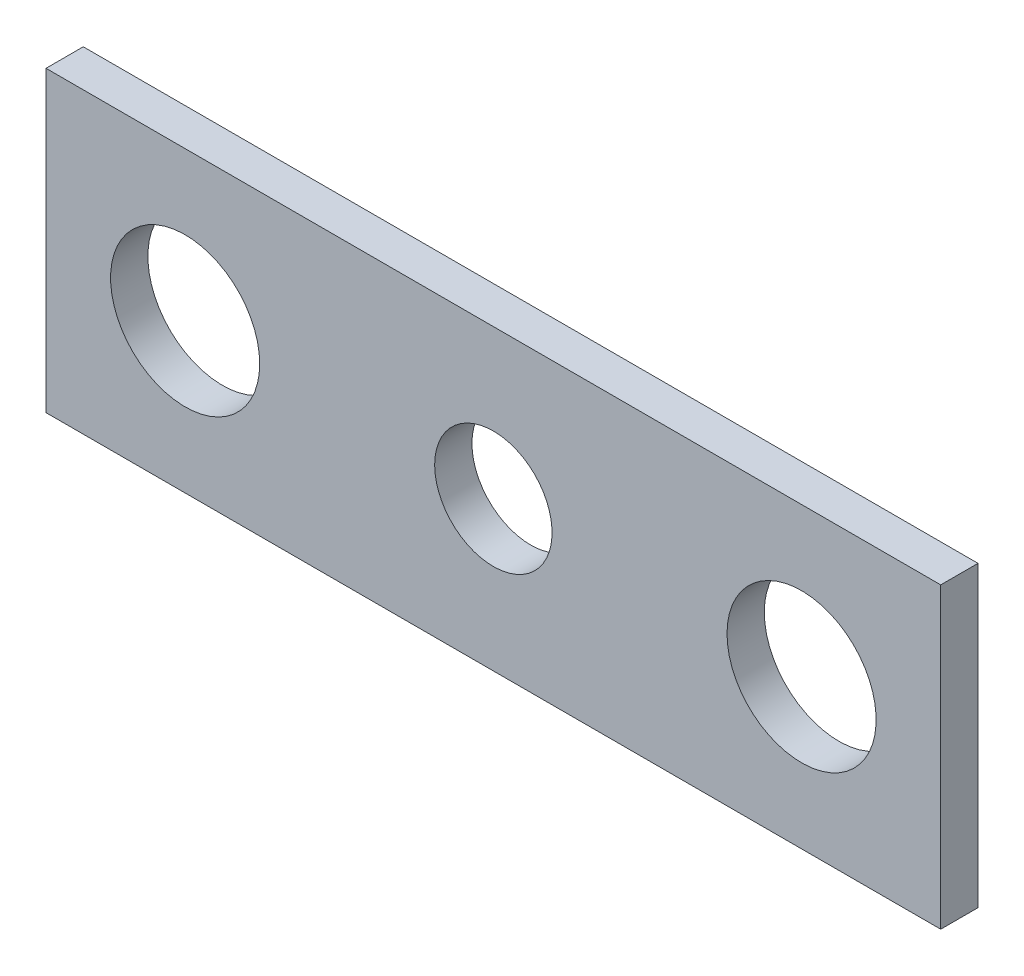
ISO-10303-21;
HEADER;
FILE_DESCRIPTION(('STEP AP214'),'2;1');
FILE_NAME('part.step','',(''),(''),'','','');
FILE_SCHEMA(('AUTOMOTIVE_DESIGN { 1 0 10303 214 1 1 1 1 }'));
ENDSEC;
DATA;
#1=APPLICATION_CONTEXT('core data for automotive mechanical design processes');
#2=APPLICATION_PROTOCOL_DEFINITION('international standard','automotive_design',2000,#1);
#3=PRODUCT_CONTEXT('',#1,'mechanical');
#4=PRODUCT('Part','Part','',(#3));
#5=PRODUCT_RELATED_PRODUCT_CATEGORY('part','',(#4));
#6=PRODUCT_DEFINITION_FORMATION('','',#4);
#7=PRODUCT_DEFINITION_CONTEXT('part definition',#1,'design');
#8=PRODUCT_DEFINITION('design','',#6,#7);
#9=PRODUCT_DEFINITION_SHAPE('','',#8);
#10=(LENGTH_UNIT() NAMED_UNIT(*) SI_UNIT(.MILLI.,.METRE.));
#11=(NAMED_UNIT(*) PLANE_ANGLE_UNIT() SI_UNIT($,.RADIAN.));
#12=(NAMED_UNIT(*) SI_UNIT($,.STERADIAN.) SOLID_ANGLE_UNIT());
#13=UNCERTAINTY_MEASURE_WITH_UNIT(LENGTH_MEASURE(1.E-05),#10,'distance_accuracy_value','');
#14=(GEOMETRIC_REPRESENTATION_CONTEXT(3) GLOBAL_UNCERTAINTY_ASSIGNED_CONTEXT((#13)) GLOBAL_UNIT_ASSIGNED_CONTEXT((#10,
#11,#12)) REPRESENTATION_CONTEXT('',''));
#15=CARTESIAN_POINT('',(0.,0.,0.));
#16=DIRECTION('',(0.,0.,1.));
#17=DIRECTION('',(1.,0.,0.));
#18=AXIS2_PLACEMENT_3D('',#15,#16,#17);
#19=CARTESIAN_POINT('',(0.,0.,6.35));
#20=DIRECTION('',(0.,0.,1.));
#21=DIRECTION('',(1.,0.,0.));
#22=AXIS2_PLACEMENT_3D('',#19,#20,#21);
#23=PLANE('',#22);
#24=CARTESIAN_POINT('',(-128.7,25.4,6.35));
#25=DIRECTION('',(0.,0.,1.));
#26=DIRECTION('',(1.,0.,0.));
#27=AXIS2_PLACEMENT_3D('',#24,#25,#26);
#28=CIRCLE('',#27,12.7);
#29=CARTESIAN_POINT('',(-116.,25.4,6.35));
#30=VERTEX_POINT('',#29);
#31=EDGE_CURVE('E113',#30,#30,#28,.T.);
#32=ORIENTED_EDGE('',*,*,#31,.F.);
#33=EDGE_LOOP('',(#32));
#34=FACE_BOUND('',#33,.T.);
#35=DIRECTION('',(0.,1.,0.));
#36=VECTOR('',#35,1.);
#37=CARTESIAN_POINT('',(0.,0.,6.35));
#38=LINE('',#37,#36);
#39=CARTESIAN_POINT('',(0.,0.,6.35));
#40=VERTEX_POINT('',#39);
#41=CARTESIAN_POINT('',(0.,50.8,6.35));
#42=VERTEX_POINT('',#41);
#43=EDGE_CURVE('E86',#40,#42,#38,.T.);
#44=ORIENTED_EDGE('',*,*,#43,.T.);
#45=DIRECTION('',(-1.,0.,0.));
#46=VECTOR('',#45,1.);
#47=CARTESIAN_POINT('',(0.,50.8,6.35));
#48=LINE('',#47,#46);
#49=CARTESIAN_POINT('',(-152.4,50.8,6.35));
#50=VERTEX_POINT('',#49);
#51=EDGE_CURVE('E81',#42,#50,#48,.T.);
#52=ORIENTED_EDGE('',*,*,#51,.T.);
#53=DIRECTION('',(0.,-1.,0.));
#54=VECTOR('',#53,1.);
#55=CARTESIAN_POINT('',(-152.4,0.,6.35));
#56=LINE('',#55,#54);
#57=CARTESIAN_POINT('',(-152.4,0.,6.35));
#58=VERTEX_POINT('',#57);
#59=EDGE_CURVE('E84',#50,#58,#56,.T.);
#60=ORIENTED_EDGE('',*,*,#59,.T.);
#61=DIRECTION('',(1.,0.,0.));
#62=VECTOR('',#61,1.);
#63=CARTESIAN_POINT('',(0.,0.,6.35));
#64=LINE('',#63,#62);
#65=EDGE_CURVE('E51',#58,#40,#64,.T.);
#66=ORIENTED_EDGE('',*,*,#65,.T.);
#67=EDGE_LOOP('',(#44,#52,#60,#66));
#68=FACE_BOUND('',#67,.T.);
#69=CARTESIAN_POINT('',(-76.2,25.4,6.35));
#70=DIRECTION('',(0.,0.,-1.));
#71=DIRECTION('',(-1.,0.,0.));
#72=AXIS2_PLACEMENT_3D('',#69,#70,#71);
#73=CIRCLE('',#72,9.99999999999999);
#74=CARTESIAN_POINT('',(-86.2,25.4,6.35));
#75=VERTEX_POINT('',#74);
#76=EDGE_CURVE('E119',#75,#75,#73,.T.);
#77=ORIENTED_EDGE('',*,*,#76,.T.);
#78=EDGE_LOOP('',(#77));
#79=FACE_BOUND('',#78,.T.);
#80=CARTESIAN_POINT('',(-23.7,25.4,6.35));
#81=DIRECTION('',(0.,0.,-1.));
#82=DIRECTION('',(-1.,0.,0.));
#83=AXIS2_PLACEMENT_3D('',#80,#81,#82);
#84=CIRCLE('',#83,12.7);
#85=CARTESIAN_POINT('',(-36.4,25.4,6.35));
#86=VERTEX_POINT('',#85);
#87=EDGE_CURVE('E101',#86,#86,#84,.T.);
#88=ORIENTED_EDGE('',*,*,#87,.T.);
#89=EDGE_LOOP('',(#88));
#90=FACE_BOUND('',#89,.T.);
#91=ADVANCED_FACE('F34',(#34,#68,#79,#90),#23,.T.);
#92=CARTESIAN_POINT('',(0.,0.,0.));
#93=DIRECTION('',(0.,0.,1.));
#94=DIRECTION('',(1.,0.,0.));
#95=AXIS2_PLACEMENT_3D('',#92,#93,#94);
#96=PLANE('',#95);
#97=CARTESIAN_POINT('',(-76.2,25.4,0.));
#98=DIRECTION('',(0.,0.,-1.));
#99=DIRECTION('',(-1.,0.,0.));
#100=AXIS2_PLACEMENT_3D('',#97,#98,#99);
#101=CIRCLE('',#100,9.99999999999999);
#102=CARTESIAN_POINT('',(-86.2,25.4,0.));
#103=VERTEX_POINT('',#102);
#104=EDGE_CURVE('E122',#103,#103,#101,.T.);
#105=ORIENTED_EDGE('',*,*,#104,.F.);
#106=EDGE_LOOP('',(#105));
#107=FACE_BOUND('',#106,.T.);
#108=CARTESIAN_POINT('',(-128.7,25.4,0.));
#109=DIRECTION('',(0.,0.,1.));
#110=DIRECTION('',(1.,0.,0.));
#111=AXIS2_PLACEMENT_3D('',#108,#109,#110);
#112=CIRCLE('',#111,12.7);
#113=CARTESIAN_POINT('',(-116.,25.4,0.));
#114=VERTEX_POINT('',#113);
#115=EDGE_CURVE('E116',#114,#114,#112,.T.);
#116=ORIENTED_EDGE('',*,*,#115,.T.);
#117=EDGE_LOOP('',(#116));
#118=FACE_BOUND('',#117,.T.);
#119=DIRECTION('',(0.,1.,0.));
#120=VECTOR('',#119,1.);
#121=CARTESIAN_POINT('',(0.,0.,0.));
#122=LINE('',#121,#120);
#123=CARTESIAN_POINT('',(0.,0.,0.));
#124=VERTEX_POINT('',#123);
#125=CARTESIAN_POINT('',(0.,50.8,0.));
#126=VERTEX_POINT('',#125);
#127=EDGE_CURVE('E98',#124,#126,#122,.T.);
#128=ORIENTED_EDGE('',*,*,#127,.F.);
#129=DIRECTION('',(1.,0.,0.));
#130=VECTOR('',#129,1.);
#131=CARTESIAN_POINT('',(0.,0.,0.));
#132=LINE('',#131,#130);
#133=CARTESIAN_POINT('',(-152.4,0.,0.));
#134=VERTEX_POINT('',#133);
#135=EDGE_CURVE('E74',#134,#124,#132,.T.);
#136=ORIENTED_EDGE('',*,*,#135,.F.);
#137=DIRECTION('',(0.,-1.,0.));
#138=VECTOR('',#137,1.);
#139=CARTESIAN_POINT('',(-152.4,0.,0.));
#140=LINE('',#139,#138);
#141=CARTESIAN_POINT('',(-152.4,50.8,0.));
#142=VERTEX_POINT('',#141);
#143=EDGE_CURVE('E68',#142,#134,#140,.T.);
#144=ORIENTED_EDGE('',*,*,#143,.F.);
#145=DIRECTION('',(-1.,0.,0.));
#146=VECTOR('',#145,1.);
#147=CARTESIAN_POINT('',(0.,50.8,0.));
#148=LINE('',#147,#146);
#149=EDGE_CURVE('E90',#126,#142,#148,.T.);
#150=ORIENTED_EDGE('',*,*,#149,.F.);
#151=EDGE_LOOP('',(#128,#136,#144,#150));
#152=FACE_BOUND('',#151,.T.);
#153=CARTESIAN_POINT('',(-23.7,25.4,0.));
#154=DIRECTION('',(0.,0.,-1.));
#155=DIRECTION('',(-1.,0.,0.));
#156=AXIS2_PLACEMENT_3D('',#153,#154,#155);
#157=CIRCLE('',#156,12.7);
#158=CARTESIAN_POINT('',(-36.4,25.4,0.));
#159=VERTEX_POINT('',#158);
#160=EDGE_CURVE('E125',#159,#159,#157,.T.);
#161=ORIENTED_EDGE('',*,*,#160,.F.);
#162=EDGE_LOOP('',(#161));
#163=FACE_BOUND('',#162,.T.);
#164=ADVANCED_FACE('F109',(#107,#118,#152,#163),#96,.F.);
#165=CARTESIAN_POINT('',(0.,0.,6.35));
#166=DIRECTION('',(-1.,0.,0.));
#167=DIRECTION('',(0.,0.,1.));
#168=AXIS2_PLACEMENT_3D('',#165,#166,#167);
#169=PLANE('',#168);
#170=ORIENTED_EDGE('',*,*,#127,.T.);
#171=DIRECTION('',(0.,0.,-1.));
#172=VECTOR('',#171,1.);
#173=CARTESIAN_POINT('',(0.,50.8,6.35));
#174=LINE('',#173,#172);
#175=EDGE_CURVE('E11',#42,#126,#174,.T.);
#176=ORIENTED_EDGE('',*,*,#175,.F.);
#177=ORIENTED_EDGE('',*,*,#43,.F.);
#178=DIRECTION('',(0.,0.,-1.));
#179=VECTOR('',#178,1.);
#180=CARTESIAN_POINT('',(0.,0.,6.35));
#181=LINE('',#180,#179);
#182=EDGE_CURVE('E94',#40,#124,#181,.T.);
#183=ORIENTED_EDGE('',*,*,#182,.T.);
#184=EDGE_LOOP('',(#170,#176,#177,#183));
#185=FACE_BOUND('',#184,.T.);
#186=ADVANCED_FACE('F36',(#185),#169,.F.);
#187=CARTESIAN_POINT('',(0.,50.8,6.35));
#188=DIRECTION('',(0.,-1.,0.));
#189=DIRECTION('',(1.,0.,0.));
#190=AXIS2_PLACEMENT_3D('',#187,#188,#189);
#191=PLANE('',#190);
#192=ORIENTED_EDGE('',*,*,#149,.T.);
#193=DIRECTION('',(0.,0.,-1.));
#194=VECTOR('',#193,1.);
#195=CARTESIAN_POINT('',(-152.4,50.8,6.35));
#196=LINE('',#195,#194);
#197=EDGE_CURVE('E43',#50,#142,#196,.T.);
#198=ORIENTED_EDGE('',*,*,#197,.F.);
#199=ORIENTED_EDGE('',*,*,#51,.F.);
#200=ORIENTED_EDGE('',*,*,#175,.T.);
#201=EDGE_LOOP('',(#192,#198,#199,#200));
#202=FACE_BOUND('',#201,.T.);
#203=ADVANCED_FACE('F89',(#202),#191,.F.);
#204=CARTESIAN_POINT('',(-152.4,0.,6.35));
#205=DIRECTION('',(1.,0.,0.));
#206=DIRECTION('',(0.,0.,-1.));
#207=AXIS2_PLACEMENT_3D('',#204,#205,#206);
#208=PLANE('',#207);
#209=ORIENTED_EDGE('',*,*,#143,.T.);
#210=DIRECTION('',(0.,0.,-1.));
#211=VECTOR('',#210,1.);
#212=CARTESIAN_POINT('',(-152.4,0.,6.35));
#213=LINE('',#212,#211);
#214=EDGE_CURVE('E91',#58,#134,#213,.T.);
#215=ORIENTED_EDGE('',*,*,#214,.F.);
#216=ORIENTED_EDGE('',*,*,#59,.F.);
#217=ORIENTED_EDGE('',*,*,#197,.T.);
#218=EDGE_LOOP('',(#209,#215,#216,#217));
#219=FACE_BOUND('',#218,.T.);
#220=ADVANCED_FACE('F92',(#219),#208,.F.);
#221=CARTESIAN_POINT('',(0.,0.,6.35));
#222=DIRECTION('',(0.,1.,0.));
#223=DIRECTION('',(-1.,0.,0.));
#224=AXIS2_PLACEMENT_3D('',#221,#222,#223);
#225=PLANE('',#224);
#226=ORIENTED_EDGE('',*,*,#135,.T.);
#227=ORIENTED_EDGE('',*,*,#182,.F.);
#228=ORIENTED_EDGE('',*,*,#65,.F.);
#229=ORIENTED_EDGE('',*,*,#214,.T.);
#230=EDGE_LOOP('',(#226,#227,#228,#229));
#231=FACE_BOUND('',#230,.T.);
#232=ADVANCED_FACE('F106',(#231),#225,.F.);
#233=CARTESIAN_POINT('',(-128.7,25.4,6.35));
#234=DIRECTION('',(0.,0.,-1.));
#235=DIRECTION('',(-1.,0.,0.));
#236=AXIS2_PLACEMENT_3D('',#233,#234,#235);
#237=CYLINDRICAL_SURFACE('',#236,12.7);
#238=ORIENTED_EDGE('',*,*,#31,.T.);
#239=EDGE_LOOP('',(#238));
#240=FACE_BOUND('',#239,.T.);
#241=ORIENTED_EDGE('',*,*,#115,.F.);
#242=EDGE_LOOP('',(#241));
#243=FACE_BOUND('',#242,.T.);
#244=ADVANCED_FACE('F153',(#240,#243),#237,.F.);
#245=CARTESIAN_POINT('',(-76.2,25.4,6.35));
#246=DIRECTION('',(0.,0.,-1.));
#247=DIRECTION('',(-1.,0.,0.));
#248=AXIS2_PLACEMENT_3D('',#245,#246,#247);
#249=CYLINDRICAL_SURFACE('',#248,9.99999999999999);
#250=ORIENTED_EDGE('',*,*,#76,.F.);
#251=EDGE_LOOP('',(#250));
#252=FACE_BOUND('',#251,.T.);
#253=ORIENTED_EDGE('',*,*,#104,.T.);
#254=EDGE_LOOP('',(#253));
#255=FACE_BOUND('',#254,.T.);
#256=ADVANCED_FACE('F135',(#252,#255),#249,.F.);
#257=CARTESIAN_POINT('',(-23.7,25.4,6.35));
#258=DIRECTION('',(0.,0.,-1.));
#259=DIRECTION('',(-1.,0.,0.));
#260=AXIS2_PLACEMENT_3D('',#257,#258,#259);
#261=CYLINDRICAL_SURFACE('',#260,12.7);
#262=ORIENTED_EDGE('',*,*,#87,.F.);
#263=EDGE_LOOP('',(#262));
#264=FACE_BOUND('',#263,.T.);
#265=ORIENTED_EDGE('',*,*,#160,.T.);
#266=EDGE_LOOP('',(#265));
#267=FACE_BOUND('',#266,.T.);
#268=ADVANCED_FACE('F132',(#264,#267),#261,.F.);
#269=CLOSED_SHELL('',(#91,#164,#186,#203,#220,#232,#244,#256,#268));
#270=MANIFOLD_SOLID_BREP('B2',#269);
#271=ADVANCED_BREP_SHAPE_REPRESENTATION('',(#18,#270),#14);
#272=SHAPE_DEFINITION_REPRESENTATION(#9,#271);
ENDSEC;
END-ISO-10303-21;
